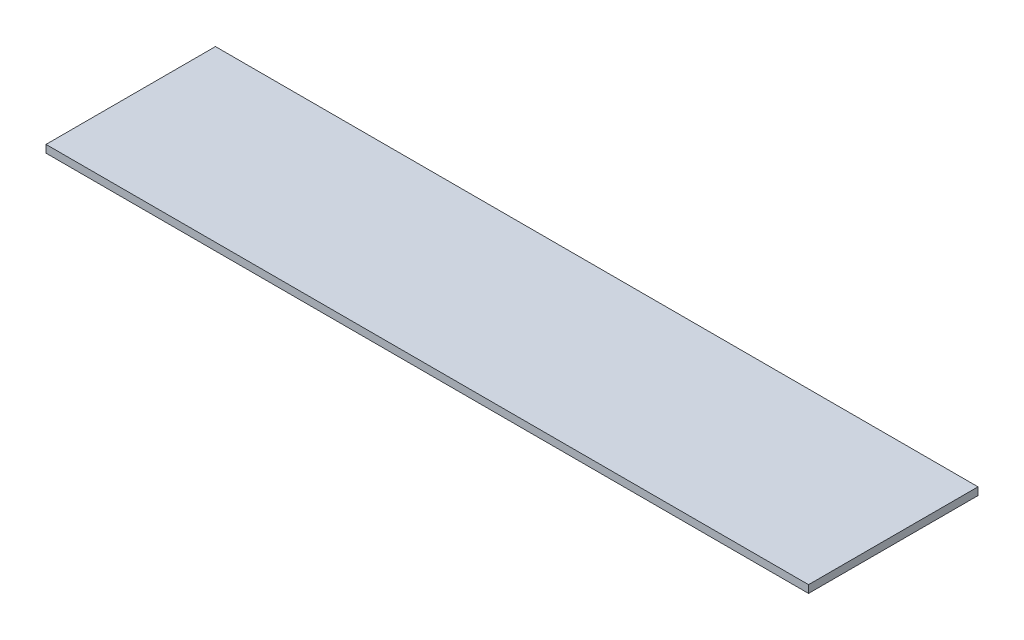
ISO-10303-21;
HEADER;
FILE_DESCRIPTION(('STEP AP214'),'2;1');
FILE_NAME('part.step','',(''),(''),'','','');
FILE_SCHEMA(('AUTOMOTIVE_DESIGN { 1 0 10303 214 1 1 1 1 }'));
ENDSEC;
DATA;
#1=APPLICATION_CONTEXT('core data for automotive mechanical design processes');
#2=APPLICATION_PROTOCOL_DEFINITION('international standard','automotive_design',2000,#1);
#3=PRODUCT_CONTEXT('',#1,'mechanical');
#4=PRODUCT('Part','Part','',(#3));
#5=PRODUCT_RELATED_PRODUCT_CATEGORY('part','',(#4));
#6=PRODUCT_DEFINITION_FORMATION('','',#4);
#7=PRODUCT_DEFINITION_CONTEXT('part definition',#1,'design');
#8=PRODUCT_DEFINITION('design','',#6,#7);
#9=PRODUCT_DEFINITION_SHAPE('','',#8);
#10=(LENGTH_UNIT() NAMED_UNIT(*) SI_UNIT(.MILLI.,.METRE.));
#11=(NAMED_UNIT(*) PLANE_ANGLE_UNIT() SI_UNIT($,.RADIAN.));
#12=(NAMED_UNIT(*) SI_UNIT($,.STERADIAN.) SOLID_ANGLE_UNIT());
#13=UNCERTAINTY_MEASURE_WITH_UNIT(LENGTH_MEASURE(1.E-05),#10,'distance_accuracy_value','');
#14=(GEOMETRIC_REPRESENTATION_CONTEXT(3) GLOBAL_UNCERTAINTY_ASSIGNED_CONTEXT((#13)) GLOBAL_UNIT_ASSIGNED_CONTEXT((#10,
#11,#12)) REPRESENTATION_CONTEXT('',''));
#15=CARTESIAN_POINT('',(0.,0.,0.));
#16=DIRECTION('',(0.,0.,1.));
#17=DIRECTION('',(1.,0.,0.));
#18=AXIS2_PLACEMENT_3D('',#15,#16,#17);
#19=CARTESIAN_POINT('',(0.,0.45,0.));
#20=DIRECTION('',(1.,0.,0.));
#21=DIRECTION('',(0.,0.,-1.));
#22=AXIS2_PLACEMENT_3D('',#19,#20,#21);
#23=PLANE('',#22);
#24=DIRECTION('',(0.,0.,1.));
#25=VECTOR('',#24,1.);
#26=CARTESIAN_POINT('',(0.,0.,0.));
#27=LINE('',#26,#25);
#28=CARTESIAN_POINT('',(0.,0.,-10.));
#29=VERTEX_POINT('',#28);
#30=CARTESIAN_POINT('',(0.,0.,0.));
#31=VERTEX_POINT('',#30);
#32=EDGE_CURVE('E109',#29,#31,#27,.T.);
#33=ORIENTED_EDGE('',*,*,#32,.T.);
#34=DIRECTION('',(0.,-1.,0.));
#35=VECTOR('',#34,1.);
#36=CARTESIAN_POINT('',(0.,0.45,0.));
#37=LINE('',#36,#35);
#38=CARTESIAN_POINT('',(0.,0.45,0.));
#39=VERTEX_POINT('',#38);
#40=EDGE_CURVE('E11',#39,#31,#37,.T.);
#41=ORIENTED_EDGE('',*,*,#40,.F.);
#42=DIRECTION('',(0.,0.,1.));
#43=VECTOR('',#42,1.);
#44=CARTESIAN_POINT('',(0.,0.45,0.));
#45=LINE('',#44,#43);
#46=CARTESIAN_POINT('',(0.,0.45,-10.));
#47=VERTEX_POINT('',#46);
#48=EDGE_CURVE('E93',#47,#39,#45,.T.);
#49=ORIENTED_EDGE('',*,*,#48,.F.);
#50=DIRECTION('',(0.,-1.,0.));
#51=VECTOR('',#50,1.);
#52=CARTESIAN_POINT('',(0.,0.45,-10.));
#53=LINE('',#52,#51);
#54=EDGE_CURVE('E105',#47,#29,#53,.T.);
#55=ORIENTED_EDGE('',*,*,#54,.T.);
#56=EDGE_LOOP('',(#33,#41,#49,#55));
#57=FACE_BOUND('',#56,.T.);
#58=ADVANCED_FACE('F41',(#57),#23,.F.);
#59=CARTESIAN_POINT('',(0.,0.45,0.));
#60=DIRECTION('',(0.,0.,-1.));
#61=DIRECTION('',(-1.,0.,0.));
#62=AXIS2_PLACEMENT_3D('',#59,#60,#61);
#63=PLANE('',#62);
#64=DIRECTION('',(1.,0.,0.));
#65=VECTOR('',#64,1.);
#66=CARTESIAN_POINT('',(0.,0.,0.));
#67=LINE('',#66,#65);
#68=CARTESIAN_POINT('',(45.,0.,0.));
#69=VERTEX_POINT('',#68);
#70=EDGE_CURVE('E98',#31,#69,#67,.T.);
#71=ORIENTED_EDGE('',*,*,#70,.T.);
#72=DIRECTION('',(0.,-1.,0.));
#73=VECTOR('',#72,1.);
#74=CARTESIAN_POINT('',(45.,0.45,0.));
#75=LINE('',#74,#73);
#76=CARTESIAN_POINT('',(45.,0.45,0.));
#77=VERTEX_POINT('',#76);
#78=EDGE_CURVE('E50',#77,#69,#75,.T.);
#79=ORIENTED_EDGE('',*,*,#78,.F.);
#80=DIRECTION('',(1.,0.,0.));
#81=VECTOR('',#80,1.);
#82=CARTESIAN_POINT('',(0.,0.45,0.));
#83=LINE('',#82,#81);
#84=EDGE_CURVE('E88',#39,#77,#83,.T.);
#85=ORIENTED_EDGE('',*,*,#84,.F.);
#86=ORIENTED_EDGE('',*,*,#40,.T.);
#87=EDGE_LOOP('',(#71,#79,#85,#86));
#88=FACE_BOUND('',#87,.T.);
#89=ADVANCED_FACE('F97',(#88),#63,.F.);
#90=CARTESIAN_POINT('',(45.,0.45,0.));
#91=DIRECTION('',(-1.,0.,0.));
#92=DIRECTION('',(0.,0.,1.));
#93=AXIS2_PLACEMENT_3D('',#90,#91,#92);
#94=PLANE('',#93);
#95=DIRECTION('',(0.,0.,-1.));
#96=VECTOR('',#95,1.);
#97=CARTESIAN_POINT('',(45.,0.,0.));
#98=LINE('',#97,#96);
#99=CARTESIAN_POINT('',(45.,0.,-10.));
#100=VERTEX_POINT('',#99);
#101=EDGE_CURVE('E75',#69,#100,#98,.T.);
#102=ORIENTED_EDGE('',*,*,#101,.T.);
#103=DIRECTION('',(0.,-1.,0.));
#104=VECTOR('',#103,1.);
#105=CARTESIAN_POINT('',(45.,0.45,-10.));
#106=LINE('',#105,#104);
#107=CARTESIAN_POINT('',(45.,0.45,-10.));
#108=VERTEX_POINT('',#107);
#109=EDGE_CURVE('E100',#108,#100,#106,.T.);
#110=ORIENTED_EDGE('',*,*,#109,.F.);
#111=DIRECTION('',(0.,0.,-1.));
#112=VECTOR('',#111,1.);
#113=CARTESIAN_POINT('',(45.,0.45,0.));
#114=LINE('',#113,#112);
#115=EDGE_CURVE('E91',#77,#108,#114,.T.);
#116=ORIENTED_EDGE('',*,*,#115,.F.);
#117=ORIENTED_EDGE('',*,*,#78,.T.);
#118=EDGE_LOOP('',(#102,#110,#116,#117));
#119=FACE_BOUND('',#118,.T.);
#120=ADVANCED_FACE('F101',(#119),#94,.F.);
#121=CARTESIAN_POINT('',(0.,0.45,-10.));
#122=DIRECTION('',(0.,0.,1.));
#123=DIRECTION('',(1.,0.,0.));
#124=AXIS2_PLACEMENT_3D('',#121,#122,#123);
#125=PLANE('',#124);
#126=DIRECTION('',(-1.,0.,0.));
#127=VECTOR('',#126,1.);
#128=CARTESIAN_POINT('',(0.,0.,-10.));
#129=LINE('',#128,#127);
#130=EDGE_CURVE('E81',#100,#29,#129,.T.);
#131=ORIENTED_EDGE('',*,*,#130,.T.);
#132=ORIENTED_EDGE('',*,*,#54,.F.);
#133=DIRECTION('',(-1.,0.,0.));
#134=VECTOR('',#133,1.);
#135=CARTESIAN_POINT('',(0.,0.45,-10.));
#136=LINE('',#135,#134);
#137=EDGE_CURVE('E58',#108,#47,#136,.T.);
#138=ORIENTED_EDGE('',*,*,#137,.F.);
#139=ORIENTED_EDGE('',*,*,#109,.T.);
#140=EDGE_LOOP('',(#131,#132,#138,#139));
#141=FACE_BOUND('',#140,.T.);
#142=ADVANCED_FACE('F122',(#141),#125,.F.);
#143=CARTESIAN_POINT('',(0.,0.45,0.));
#144=DIRECTION('',(0.,-1.,0.));
#145=DIRECTION('',(0.,0.,-1.));
#146=AXIS2_PLACEMENT_3D('',#143,#144,#145);
#147=PLANE('',#146);
#148=ORIENTED_EDGE('',*,*,#48,.T.);
#149=ORIENTED_EDGE('',*,*,#84,.T.);
#150=ORIENTED_EDGE('',*,*,#115,.T.);
#151=ORIENTED_EDGE('',*,*,#137,.T.);
#152=EDGE_LOOP('',(#148,#149,#150,#151));
#153=FACE_BOUND('',#152,.T.);
#154=ADVANCED_FACE('F89',(#153),#147,.F.);
#155=CARTESIAN_POINT('',(0.,0.,0.));
#156=DIRECTION('',(0.,-1.,0.));
#157=DIRECTION('',(0.,0.,-1.));
#158=AXIS2_PLACEMENT_3D('',#155,#156,#157);
#159=PLANE('',#158);
#160=ORIENTED_EDGE('',*,*,#32,.F.);
#161=ORIENTED_EDGE('',*,*,#130,.F.);
#162=ORIENTED_EDGE('',*,*,#101,.F.);
#163=ORIENTED_EDGE('',*,*,#70,.F.);
#164=EDGE_LOOP('',(#160,#161,#162,#163));
#165=FACE_BOUND('',#164,.T.);
#166=ADVANCED_FACE('F125',(#165),#159,.T.);
#167=CLOSED_SHELL('',(#58,#89,#120,#142,#154,#166));
#168=MANIFOLD_SOLID_BREP('B2',#167);
#169=ADVANCED_BREP_SHAPE_REPRESENTATION('',(#18,#168),#14);
#170=SHAPE_DEFINITION_REPRESENTATION(#9,#169);
ENDSEC;
END-ISO-10303-21;
